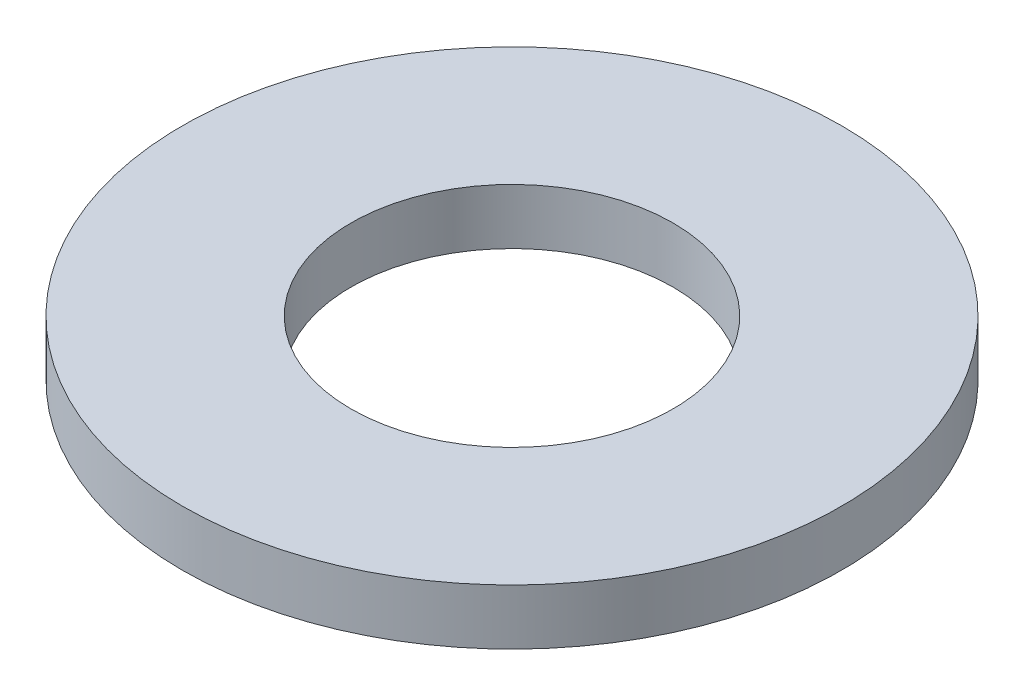
ISO-10303-21;
HEADER;
FILE_DESCRIPTION(('STEP AP214'),'2;1');
FILE_NAME('part.step','',(''),(''),'','','');
FILE_SCHEMA(('AUTOMOTIVE_DESIGN { 1 0 10303 214 1 1 1 1 }'));
ENDSEC;
DATA;
#1=APPLICATION_CONTEXT('core data for automotive mechanical design processes');
#2=APPLICATION_PROTOCOL_DEFINITION('international standard','automotive_design',2000,#1);
#3=PRODUCT_CONTEXT('',#1,'mechanical');
#4=PRODUCT('Part','Part','',(#3));
#5=PRODUCT_RELATED_PRODUCT_CATEGORY('part','',(#4));
#6=PRODUCT_DEFINITION_FORMATION('','',#4);
#7=PRODUCT_DEFINITION_CONTEXT('part definition',#1,'design');
#8=PRODUCT_DEFINITION('design','',#6,#7);
#9=PRODUCT_DEFINITION_SHAPE('','',#8);
#10=(LENGTH_UNIT() NAMED_UNIT(*) SI_UNIT(.MILLI.,.METRE.));
#11=(NAMED_UNIT(*) PLANE_ANGLE_UNIT() SI_UNIT($,.RADIAN.));
#12=(NAMED_UNIT(*) SI_UNIT($,.STERADIAN.) SOLID_ANGLE_UNIT());
#13=UNCERTAINTY_MEASURE_WITH_UNIT(LENGTH_MEASURE(1.E-05),#10,'distance_accuracy_value','');
#14=(GEOMETRIC_REPRESENTATION_CONTEXT(3) GLOBAL_UNCERTAINTY_ASSIGNED_CONTEXT((#13)) GLOBAL_UNIT_ASSIGNED_CONTEXT((#10,
#11,#12)) REPRESENTATION_CONTEXT('',''));
#15=CARTESIAN_POINT('',(0.,0.,0.));
#16=DIRECTION('',(0.,0.,1.));
#17=DIRECTION('',(1.,0.,0.));
#18=AXIS2_PLACEMENT_3D('',#15,#16,#17);
#19=CARTESIAN_POINT('',(0.,0.75,0.));
#20=DIRECTION('',(0.,1.,0.));
#21=DIRECTION('',(0.,0.,1.));
#22=AXIS2_PLACEMENT_3D('',#19,#20,#21);
#23=PLANE('',#22);
#24=CARTESIAN_POINT('',(0.,0.75,0.));
#25=DIRECTION('',(0.,1.,0.));
#26=DIRECTION('',(0.,0.,1.));
#27=AXIS2_PLACEMENT_3D('',#24,#25,#26);
#28=CIRCLE('',#27,4.45);
#29=CARTESIAN_POINT('',(0.,0.75,4.45));
#30=VERTEX_POINT('',#29);
#31=EDGE_CURVE('E10',#30,#30,#28,.T.);
#32=ORIENTED_EDGE('',*,*,#31,.T.);
#33=EDGE_LOOP('',(#32));
#34=FACE_BOUND('',#33,.T.);
#35=CARTESIAN_POINT('',(0.,0.75,0.));
#36=DIRECTION('',(0.,1.,0.));
#37=DIRECTION('',(0.,0.,1.));
#38=AXIS2_PLACEMENT_3D('',#35,#36,#37);
#39=CIRCLE('',#38,2.175);
#40=CARTESIAN_POINT('',(0.,0.75,2.175));
#41=VERTEX_POINT('',#40);
#42=EDGE_CURVE('E41',#41,#41,#39,.T.);
#43=ORIENTED_EDGE('',*,*,#42,.F.);
#44=EDGE_LOOP('',(#43));
#45=FACE_BOUND('',#44,.T.);
#46=ADVANCED_FACE('F30',(#34,#45),#23,.T.);
#47=CARTESIAN_POINT('',(0.,0.,0.));
#48=DIRECTION('',(0.,1.,0.));
#49=DIRECTION('',(0.,0.,1.));
#50=AXIS2_PLACEMENT_3D('',#47,#48,#49);
#51=PLANE('',#50);
#52=CARTESIAN_POINT('',(0.,0.,0.));
#53=DIRECTION('',(0.,1.,0.));
#54=DIRECTION('',(0.,0.,1.));
#55=AXIS2_PLACEMENT_3D('',#52,#53,#54);
#56=CIRCLE('',#55,4.45);
#57=CARTESIAN_POINT('',(0.,0.,4.45));
#58=VERTEX_POINT('',#57);
#59=EDGE_CURVE('E34',#58,#58,#56,.T.);
#60=ORIENTED_EDGE('',*,*,#59,.F.);
#61=EDGE_LOOP('',(#60));
#62=FACE_BOUND('',#61,.T.);
#63=CARTESIAN_POINT('',(0.,0.,0.));
#64=DIRECTION('',(0.,1.,0.));
#65=DIRECTION('',(0.,0.,1.));
#66=AXIS2_PLACEMENT_3D('',#63,#64,#65);
#67=CIRCLE('',#66,2.175);
#68=CARTESIAN_POINT('',(0.,0.,2.175));
#69=VERTEX_POINT('',#68);
#70=EDGE_CURVE('E43',#69,#69,#67,.T.);
#71=ORIENTED_EDGE('',*,*,#70,.T.);
#72=EDGE_LOOP('',(#71));
#73=FACE_BOUND('',#72,.T.);
#74=ADVANCED_FACE('F53',(#62,#73),#51,.F.);
#75=CARTESIAN_POINT('',(0.,0.75,0.));
#76=DIRECTION('',(0.,-1.,0.));
#77=DIRECTION('',(0.,0.,-1.));
#78=AXIS2_PLACEMENT_3D('',#75,#76,#77);
#79=CYLINDRICAL_SURFACE('',#78,4.45);
#80=ORIENTED_EDGE('',*,*,#31,.F.);
#81=EDGE_LOOP('',(#80));
#82=FACE_BOUND('',#81,.T.);
#83=ORIENTED_EDGE('',*,*,#59,.T.);
#84=EDGE_LOOP('',(#83));
#85=FACE_BOUND('',#84,.T.);
#86=ADVANCED_FACE('F32',(#82,#85),#79,.T.);
#87=CARTESIAN_POINT('',(0.,0.75,0.));
#88=DIRECTION('',(0.,-1.,0.));
#89=DIRECTION('',(0.,0.,-1.));
#90=AXIS2_PLACEMENT_3D('',#87,#88,#89);
#91=CYLINDRICAL_SURFACE('',#90,2.175);
#92=ORIENTED_EDGE('',*,*,#42,.T.);
#93=EDGE_LOOP('',(#92));
#94=FACE_BOUND('',#93,.T.);
#95=ORIENTED_EDGE('',*,*,#70,.F.);
#96=EDGE_LOOP('',(#95));
#97=FACE_BOUND('',#96,.T.);
#98=ADVANCED_FACE('F49',(#94,#97),#91,.F.);
#99=CLOSED_SHELL('',(#46,#74,#86,#98));
#100=MANIFOLD_SOLID_BREP('B2',#99);
#101=ADVANCED_BREP_SHAPE_REPRESENTATION('',(#18,#100),#14);
#102=SHAPE_DEFINITION_REPRESENTATION(#9,#101);
ENDSEC;
END-ISO-10303-21;
